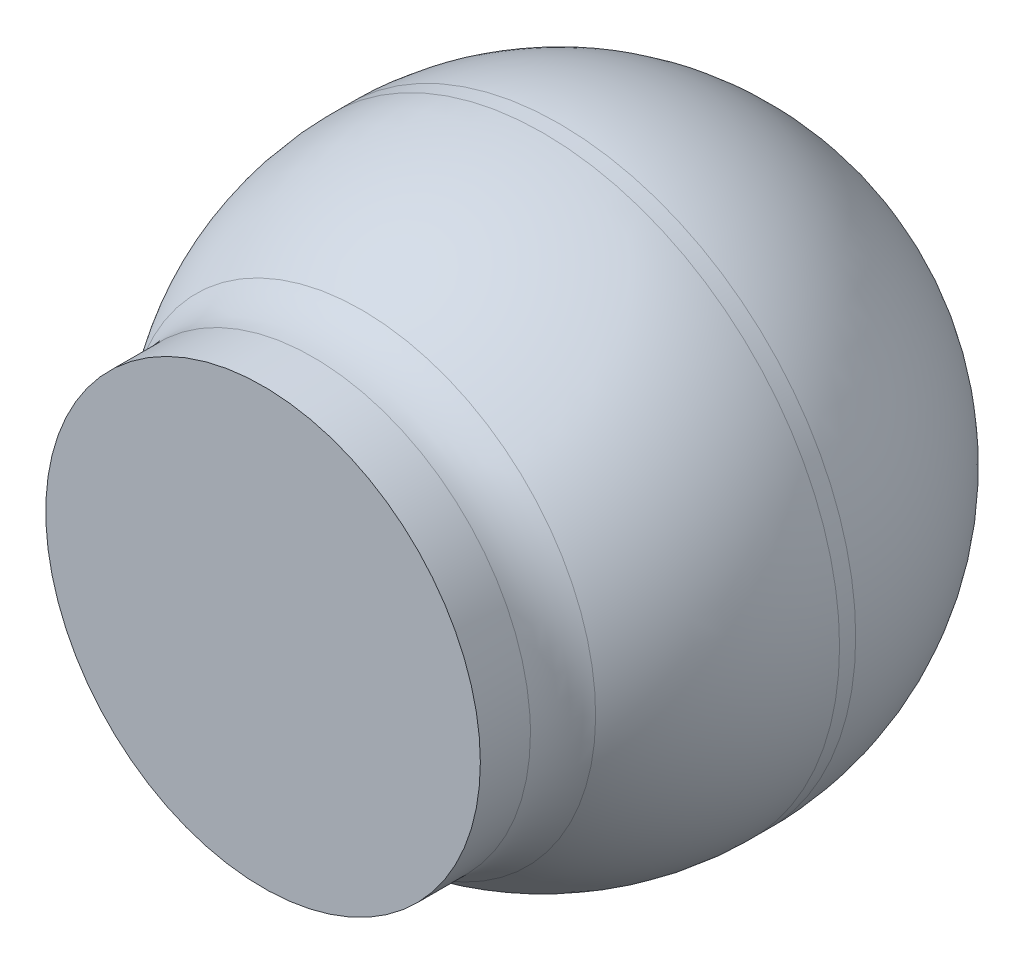
ISO-10303-21;
HEADER;
FILE_DESCRIPTION(('STEP AP214'),'2;1');
FILE_NAME('part.step','',(''),(''),'','','');
FILE_SCHEMA(('AUTOMOTIVE_DESIGN { 1 0 10303 214 1 1 1 1 }'));
ENDSEC;
DATA;
#1=APPLICATION_CONTEXT('core data for automotive mechanical design processes');
#2=APPLICATION_PROTOCOL_DEFINITION('international standard','automotive_design',2000,#1);
#3=PRODUCT_CONTEXT('',#1,'mechanical');
#4=PRODUCT('Part','Part','',(#3));
#5=PRODUCT_RELATED_PRODUCT_CATEGORY('part','',(#4));
#6=PRODUCT_DEFINITION_FORMATION('','',#4);
#7=PRODUCT_DEFINITION_CONTEXT('part definition',#1,'design');
#8=PRODUCT_DEFINITION('design','',#6,#7);
#9=PRODUCT_DEFINITION_SHAPE('','',#8);
#10=(LENGTH_UNIT() NAMED_UNIT(*) SI_UNIT(.MILLI.,.METRE.));
#11=(NAMED_UNIT(*) PLANE_ANGLE_UNIT() SI_UNIT($,.RADIAN.));
#12=(NAMED_UNIT(*) SI_UNIT($,.STERADIAN.) SOLID_ANGLE_UNIT());
#13=UNCERTAINTY_MEASURE_WITH_UNIT(LENGTH_MEASURE(1.E-05),#10,'distance_accuracy_value','');
#14=(GEOMETRIC_REPRESENTATION_CONTEXT(3) GLOBAL_UNCERTAINTY_ASSIGNED_CONTEXT((#13)) GLOBAL_UNIT_ASSIGNED_CONTEXT((#10,
#11,#12)) REPRESENTATION_CONTEXT('',''));
#15=CARTESIAN_POINT('',(0.,0.,0.));
#16=DIRECTION('',(0.,0.,1.));
#17=DIRECTION('',(1.,0.,0.));
#18=AXIS2_PLACEMENT_3D('',#15,#16,#17);
#19=CARTESIAN_POINT('',(-5.642919922269,-6.591349291452,10.006534503384));
#20=DIRECTION('',(0.,0.,-1.));
#21=DIRECTION('',(-1.,0.,0.));
#22=AXIS2_PLACEMENT_3D('',#19,#20,#21);
#23=PLANE('',#22);
#24=CARTESIAN_POINT('',(-5.642919922269,-6.591349291452,10.006534503384));
#25=DIRECTION('',(0.,0.,1.));
#26=DIRECTION('',(1.,0.,0.));
#27=AXIS2_PLACEMENT_3D('',#24,#25,#26);
#28=CIRCLE('',#27,0.275);
#29=CARTESIAN_POINT('',(-5.367919922269,-6.591349291452,10.006534503384));
#30=VERTEX_POINT('',#29);
#31=EDGE_CURVE('E20',#30,#30,#28,.F.);
#32=ORIENTED_EDGE('',*,*,#31,.F.);
#33=EDGE_LOOP('',(#32));
#34=FACE_BOUND('',#33,.T.);
#35=ADVANCED_FACE('F17',(#34),#23,.F.);
#36=CARTESIAN_POINT('',(-5.642919922269,-6.591349291452,9.906534503384));
#37=DIRECTION('',(0.,0.,1.));
#38=DIRECTION('',(1.,0.,0.));
#39=AXIS2_PLACEMENT_3D('',#36,#37,#38);
#40=CYLINDRICAL_SURFACE('',#39,0.275);
#41=CARTESIAN_POINT('',(-5.642919922269,-6.591349291452,9.943180457728));
#42=DIRECTION('',(0.,0.,-1.));
#43=DIRECTION('',(0.996700902337583,0.0811622527992439,0.));
#44=AXIS2_PLACEMENT_3D('',#41,#42,#43);
#45=CIRCLE('',#44,0.275);
#46=CARTESIAN_POINT('',(-5.36882717412616,-6.56902967193221,9.943180457728));
#47=VERTEX_POINT('',#46);
#48=EDGE_CURVE('E65',#47,#47,#45,.F.);
#49=ORIENTED_EDGE('',*,*,#48,.T.);
#50=EDGE_LOOP('',(#49));
#51=FACE_BOUND('',#50,.T.);
#52=ORIENTED_EDGE('',*,*,#31,.T.);
#53=EDGE_LOOP('',(#52));
#54=FACE_BOUND('',#53,.T.);
#55=ADVANCED_FACE('F62',(#51,#54),#40,.T.);
#56=CARTESIAN_POINT('',(-5.642919922269,-6.591349291452,9.943180457728));
#57=DIRECTION('',(0.,0.,-1.));
#58=DIRECTION('',(0.996700902337583,0.0811622527992448,0.));
#59=AXIS2_PLACEMENT_3D('',#56,#57,#58);
#60=TOROIDAL_SURFACE('',#59,0.375,0.1);
#61=ORIENTED_EDGE('',*,*,#48,.F.);
#62=EDGE_LOOP('',(#61));
#63=FACE_BOUND('',#62,.T.);
#64=CARTESIAN_POINT('',(-5.642919922269,-6.591349291452,9.881744931236));
#65=DIRECTION('',(0.,0.,-1.));
#66=DIRECTION('',(-0.996700902337598,-0.0811622527990591,0.));
#67=AXIS2_PLACEMENT_3D('',#64,#65,#66);
#68=CIRCLE('',#67,0.296097046412666);
#69=CARTESIAN_POINT('',(-5.938040115608,-6.615381194786,9.881744931236));
#70=VERTEX_POINT('',#69);
#71=EDGE_CURVE('E39',#70,#70,#68,.T.);
#72=ORIENTED_EDGE('',*,*,#71,.F.);
#73=EDGE_LOOP('',(#72));
#74=FACE_BOUND('',#73,.T.);
#75=ADVANCED_FACE('F57',(#63,#74),#60,.F.);
#76=CARTESIAN_POINT('',(-6.016682760645,-6.621785136252,9.651976062157));
#77=CARTESIAN_POINT('',(-6.016682760645,-6.621785136252,9.701461392103));
#78=CARTESIAN_POINT('',(-6.008526217348,-6.621120941579,9.750947004335));
#79=CARTESIAN_POINT('',(-5.992207085349,-6.619792059952,9.798626332798));
#80=CARTESIAN_POINT('',(-5.968341390838,-6.617848654938,9.842699544317));
#81=CARTESIAN_POINT('',(-5.938040115608,-6.615381194786,9.881744931236));
#82=(BOUNDED_CURVE() B_SPLINE_CURVE(5,(#76,#77,#78,#79,#80,#81),.UNSPECIFIED.,.F.,
.F.) B_SPLINE_CURVE_WITH_KNOTS((6,6),(0.,0.661568582165),
.UNSPECIFIED.) CURVE() GEOMETRIC_REPRESENTATION_ITEM() RATIONAL_B_SPLINE_CURVE((1.,1.,1.,1.,1.,1.)) REPRESENTATION_ITEM(''));
#83=CARTESIAN_POINT('',(-5.642919922269,-6.591349291452,9.651976062157));
#84=DIRECTION('',(0.,0.,-1.));
#85=AXIS1_PLACEMENT('',#83,#84);
#86=SURFACE_OF_REVOLUTION('',#82,#85);
#87=CARTESIAN_POINT('',(-5.642919922269,-6.591349291452,9.651976062157));
#88=DIRECTION('',(0.,0.,1.));
#89=DIRECTION('',(1.,0.,0.));
#90=AXIS2_PLACEMENT_3D('',#87,#88,#89);
#91=CIRCLE('',#90,0.375);
#92=CARTESIAN_POINT('',(-5.267919922269,-6.591349291452,9.651976062157));
#93=VERTEX_POINT('',#92);
#94=EDGE_CURVE('E36',#93,#93,#91,.F.);
#95=ORIENTED_EDGE('',*,*,#94,.F.);
#96=EDGE_LOOP('',(#95));
#97=FACE_BOUND('',#96,.T.);
#98=ORIENTED_EDGE('',*,*,#71,.T.);
#99=EDGE_LOOP('',(#98));
#100=FACE_BOUND('',#99,.T.);
#101=ADVANCED_FACE('F53',(#97,#100),#86,.F.);
#102=CARTESIAN_POINT('',(-5.642919922269,-6.591349291452,9.256534503384));
#103=DIRECTION('',(0.,0.,1.));
#104=DIRECTION('',(1.,0.,0.));
#105=AXIS2_PLACEMENT_3D('',#102,#103,#104);
#106=CYLINDRICAL_SURFACE('',#105,0.375);
#107=CARTESIAN_POINT('',(-5.642919922269,-6.591349291452,9.631534503384));
#108=DIRECTION('',(0.,0.,-1.));
#109=DIRECTION('',(0.0811622527992357,-0.996700902337583,0.));
#110=AXIS2_PLACEMENT_3D('',#107,#108,#109);
#111=CIRCLE('',#110,0.375);
#112=CARTESIAN_POINT('',(-5.61248407746929,-6.96511212982859,9.631534503384));
#113=VERTEX_POINT('',#112);
#114=CARTESIAN_POINT('',(-5.67335576706871,-6.21758645307541,9.631534503384));
#115=VERTEX_POINT('',#114);
#116=EDGE_CURVE('E11',#113,#115,#111,.T.);
#117=ORIENTED_EDGE('',*,*,#116,.F.);
#118=CARTESIAN_POINT('',(-5.642919922269,-6.591349291452,9.631534503384));
#119=DIRECTION('',(0.,0.,1.));
#120=DIRECTION('',(0.0811622527992365,-0.996700902337583,0.));
#121=AXIS2_PLACEMENT_3D('',#118,#119,#120);
#122=CIRCLE('',#121,0.375);
#123=EDGE_CURVE('E25',#115,#113,#122,.F.);
#124=ORIENTED_EDGE('',*,*,#123,.F.);
#125=EDGE_LOOP('',(#117,#124));
#126=FACE_BOUND('',#125,.T.);
#127=ORIENTED_EDGE('',*,*,#94,.T.);
#128=EDGE_LOOP('',(#127));
#129=FACE_BOUND('',#128,.T.);
#130=ADVANCED_FACE('F34',(#126,#129),#106,.T.);
#131=CARTESIAN_POINT('',(-5.642919922269,-6.591349291452,9.631534503384));
#132=DIRECTION('',(0.0811622527992361,-0.996700902337583,0.));
#133=DIRECTION('',(-0.996700902337583,-0.0811622527992361,0.));
#134=AXIS2_PLACEMENT_3D('',#131,#132,#133);
#135=SPHERICAL_SURFACE('',#134,0.375);
#136=ORIENTED_EDGE('',*,*,#123,.T.);
#137=ORIENTED_EDGE('',*,*,#116,.T.);
#138=EDGE_LOOP('',(#136,#137));
#139=FACE_BOUND('',#138,.T.);
#140=ADVANCED_FACE('F32',(#139),#135,.T.);
#141=CLOSED_SHELL('',(#35,#55,#75,#101,#130,#140));
#142=MANIFOLD_SOLID_BREP('B1',#141);
#143=ADVANCED_BREP_SHAPE_REPRESENTATION('',(#18,#142),#14);
#144=SHAPE_DEFINITION_REPRESENTATION(#9,#143);
ENDSEC;
END-ISO-10303-21;
